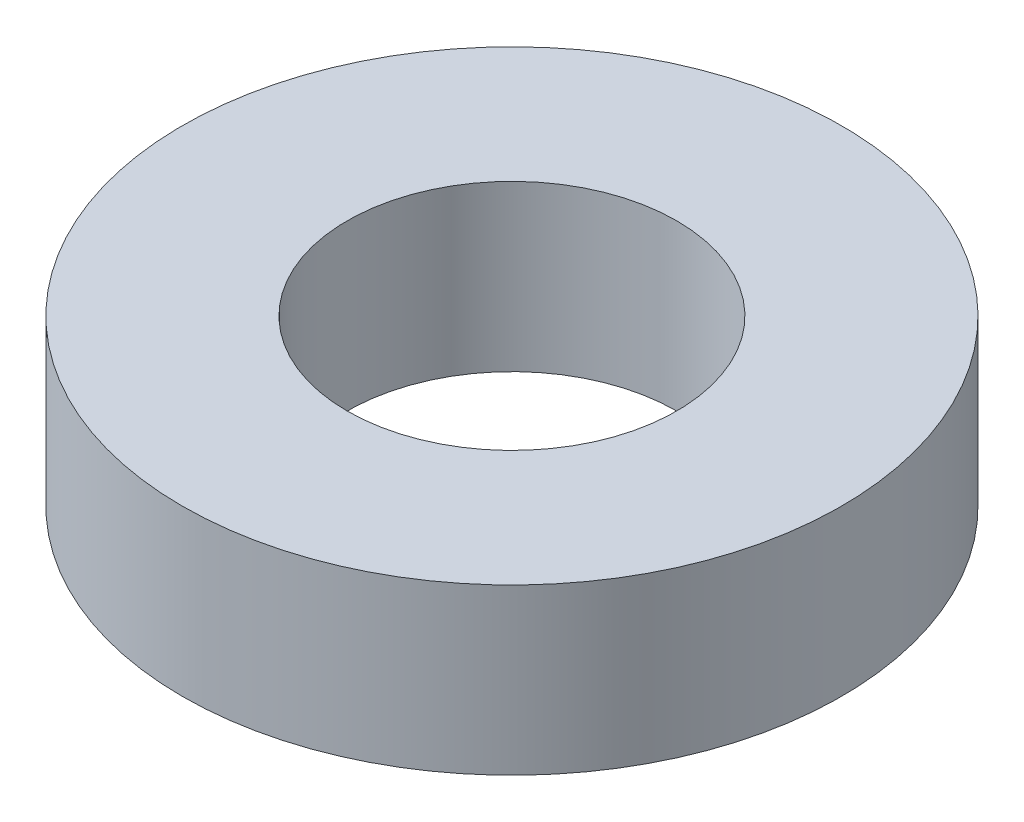
ISO-10303-21;
HEADER;
FILE_DESCRIPTION(('STEP AP214'),'2;1');
FILE_NAME('part.step','',(''),(''),'','','');
FILE_SCHEMA(('AUTOMOTIVE_DESIGN { 1 0 10303 214 1 1 1 1 }'));
ENDSEC;
DATA;
#1=APPLICATION_CONTEXT('core data for automotive mechanical design processes');
#2=APPLICATION_PROTOCOL_DEFINITION('international standard','automotive_design',2000,#1);
#3=PRODUCT_CONTEXT('',#1,'mechanical');
#4=PRODUCT('Part','Part','',(#3));
#5=PRODUCT_RELATED_PRODUCT_CATEGORY('part','',(#4));
#6=PRODUCT_DEFINITION_FORMATION('','',#4);
#7=PRODUCT_DEFINITION_CONTEXT('part definition',#1,'design');
#8=PRODUCT_DEFINITION('design','',#6,#7);
#9=PRODUCT_DEFINITION_SHAPE('','',#8);
#10=(LENGTH_UNIT() NAMED_UNIT(*) SI_UNIT(.MILLI.,.METRE.));
#11=(NAMED_UNIT(*) PLANE_ANGLE_UNIT() SI_UNIT($,.RADIAN.));
#12=(NAMED_UNIT(*) SI_UNIT($,.STERADIAN.) SOLID_ANGLE_UNIT());
#13=UNCERTAINTY_MEASURE_WITH_UNIT(LENGTH_MEASURE(1.E-05),#10,'distance_accuracy_value','');
#14=(GEOMETRIC_REPRESENTATION_CONTEXT(3) GLOBAL_UNCERTAINTY_ASSIGNED_CONTEXT((#13)) GLOBAL_UNIT_ASSIGNED_CONTEXT((#10,
#11,#12)) REPRESENTATION_CONTEXT('',''));
#15=CARTESIAN_POINT('',(0.,0.,0.));
#16=DIRECTION('',(0.,0.,1.));
#17=DIRECTION('',(1.,0.,0.));
#18=AXIS2_PLACEMENT_3D('',#15,#16,#17);
#19=CARTESIAN_POINT('',(0.,0.79375,0.));
#20=DIRECTION('',(0.,1.,0.));
#21=DIRECTION('',(0.,0.,1.));
#22=AXIS2_PLACEMENT_3D('',#19,#20,#21);
#23=PLANE('',#22);
#24=CARTESIAN_POINT('',(0.,0.79375,0.));
#25=DIRECTION('',(0.,1.,0.));
#26=DIRECTION('',(0.,0.,1.));
#27=AXIS2_PLACEMENT_3D('',#24,#25,#26);
#28=CIRCLE('',#27,3.175);
#29=CARTESIAN_POINT('',(0.,0.79375,3.175));
#30=VERTEX_POINT('',#29);
#31=EDGE_CURVE('E10',#30,#30,#28,.T.);
#32=ORIENTED_EDGE('',*,*,#31,.T.);
#33=EDGE_LOOP('',(#32));
#34=FACE_BOUND('',#33,.T.);
#35=CARTESIAN_POINT('',(0.,0.79375,0.));
#36=DIRECTION('',(0.,1.,0.));
#37=DIRECTION('',(0.,0.,1.));
#38=AXIS2_PLACEMENT_3D('',#35,#36,#37);
#39=CIRCLE('',#38,1.5875);
#40=CARTESIAN_POINT('',(0.,0.79375,1.5875));
#41=VERTEX_POINT('',#40);
#42=EDGE_CURVE('E42',#41,#41,#39,.T.);
#43=ORIENTED_EDGE('',*,*,#42,.F.);
#44=EDGE_LOOP('',(#43));
#45=FACE_BOUND('',#44,.T.);
#46=ADVANCED_FACE('F31',(#34,#45),#23,.T.);
#47=CARTESIAN_POINT('',(0.,-0.79375,0.));
#48=DIRECTION('',(0.,1.,0.));
#49=DIRECTION('',(0.,0.,1.));
#50=AXIS2_PLACEMENT_3D('',#47,#48,#49);
#51=PLANE('',#50);
#52=CARTESIAN_POINT('',(0.,-0.79375,0.));
#53=DIRECTION('',(0.,1.,0.));
#54=DIRECTION('',(0.,0.,1.));
#55=AXIS2_PLACEMENT_3D('',#52,#53,#54);
#56=CIRCLE('',#55,3.175);
#57=CARTESIAN_POINT('',(0.,-0.79375,3.175));
#58=VERTEX_POINT('',#57);
#59=EDGE_CURVE('E35',#58,#58,#56,.T.);
#60=ORIENTED_EDGE('',*,*,#59,.F.);
#61=EDGE_LOOP('',(#60));
#62=FACE_BOUND('',#61,.T.);
#63=CARTESIAN_POINT('',(0.,-0.79375,0.));
#64=DIRECTION('',(0.,1.,0.));
#65=DIRECTION('',(0.,0.,1.));
#66=AXIS2_PLACEMENT_3D('',#63,#64,#65);
#67=CIRCLE('',#66,1.5875);
#68=CARTESIAN_POINT('',(0.,-0.79375,1.5875));
#69=VERTEX_POINT('',#68);
#70=EDGE_CURVE('E44',#69,#69,#67,.T.);
#71=ORIENTED_EDGE('',*,*,#70,.T.);
#72=EDGE_LOOP('',(#71));
#73=FACE_BOUND('',#72,.T.);
#74=ADVANCED_FACE('F54',(#62,#73),#51,.F.);
#75=CARTESIAN_POINT('',(0.,0.79375,0.));
#76=DIRECTION('',(0.,-1.,0.));
#77=DIRECTION('',(0.,0.,-1.));
#78=AXIS2_PLACEMENT_3D('',#75,#76,#77);
#79=CYLINDRICAL_SURFACE('',#78,3.175);
#80=ORIENTED_EDGE('',*,*,#31,.F.);
#81=EDGE_LOOP('',(#80));
#82=FACE_BOUND('',#81,.T.);
#83=ORIENTED_EDGE('',*,*,#59,.T.);
#84=EDGE_LOOP('',(#83));
#85=FACE_BOUND('',#84,.T.);
#86=ADVANCED_FACE('F33',(#82,#85),#79,.T.);
#87=CARTESIAN_POINT('',(0.,0.79375,0.));
#88=DIRECTION('',(0.,-1.,0.));
#89=DIRECTION('',(0.,0.,-1.));
#90=AXIS2_PLACEMENT_3D('',#87,#88,#89);
#91=CYLINDRICAL_SURFACE('',#90,1.5875);
#92=ORIENTED_EDGE('',*,*,#42,.T.);
#93=EDGE_LOOP('',(#92));
#94=FACE_BOUND('',#93,.T.);
#95=ORIENTED_EDGE('',*,*,#70,.F.);
#96=EDGE_LOOP('',(#95));
#97=FACE_BOUND('',#96,.T.);
#98=ADVANCED_FACE('F50',(#94,#97),#91,.F.);
#99=CLOSED_SHELL('',(#46,#74,#86,#98));
#100=MANIFOLD_SOLID_BREP('B2',#99);
#101=ADVANCED_BREP_SHAPE_REPRESENTATION('',(#18,#100),#14);
#102=SHAPE_DEFINITION_REPRESENTATION(#9,#101);
ENDSEC;
END-ISO-10303-21;
